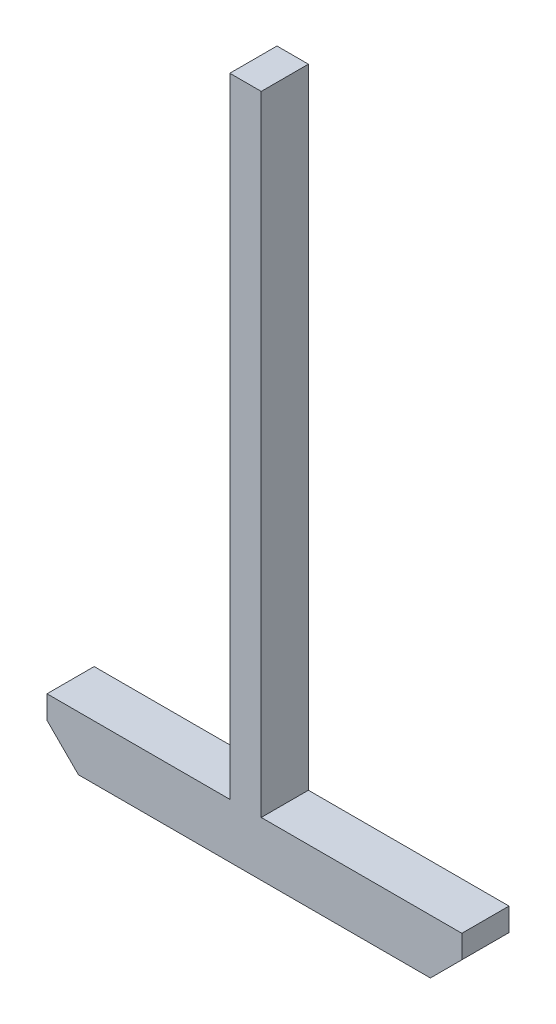
ISO-10303-21;
HEADER;
FILE_DESCRIPTION(('STEP AP214'),'2;1');
FILE_NAME('part.step','',(''),(''),'','','');
FILE_SCHEMA(('AUTOMOTIVE_DESIGN { 1 0 10303 214 1 1 1 1 }'));
ENDSEC;
DATA;
#1=APPLICATION_CONTEXT('core data for automotive mechanical design processes');
#2=APPLICATION_PROTOCOL_DEFINITION('international standard','automotive_design',2000,#1);
#3=PRODUCT_CONTEXT('',#1,'mechanical');
#4=PRODUCT('Part','Part','',(#3));
#5=PRODUCT_RELATED_PRODUCT_CATEGORY('part','',(#4));
#6=PRODUCT_DEFINITION_FORMATION('','',#4);
#7=PRODUCT_DEFINITION_CONTEXT('part definition',#1,'design');
#8=PRODUCT_DEFINITION('design','',#6,#7);
#9=PRODUCT_DEFINITION_SHAPE('','',#8);
#10=(LENGTH_UNIT() NAMED_UNIT(*) SI_UNIT(.MILLI.,.METRE.));
#11=(NAMED_UNIT(*) PLANE_ANGLE_UNIT() SI_UNIT($,.RADIAN.));
#12=(NAMED_UNIT(*) SI_UNIT($,.STERADIAN.) SOLID_ANGLE_UNIT());
#13=UNCERTAINTY_MEASURE_WITH_UNIT(LENGTH_MEASURE(1.E-05),#10,'distance_accuracy_value','');
#14=(GEOMETRIC_REPRESENTATION_CONTEXT(3) GLOBAL_UNCERTAINTY_ASSIGNED_CONTEXT((#13)) GLOBAL_UNIT_ASSIGNED_CONTEXT((#10,
#11,#12)) REPRESENTATION_CONTEXT('',''));
#15=CARTESIAN_POINT('',(0.,0.,0.));
#16=DIRECTION('',(0.,0.,1.));
#17=DIRECTION('',(1.,0.,0.));
#18=AXIS2_PLACEMENT_3D('',#15,#16,#17);
#19=CARTESIAN_POINT('',(-4.48621633540177,146.116981132075,15.));
#20=DIRECTION('',(0.,-1.,0.));
#21=DIRECTION('',(0.,0.,-1.));
#22=AXIS2_PLACEMENT_3D('',#19,#20,#21);
#23=PLANE('',#22);
#24=DIRECTION('',(-1.,0.,0.));
#25=VECTOR('',#24,1.);
#26=CARTESIAN_POINT('',(-4.48621633540177,146.116981132075,0.));
#27=LINE('',#26,#25);
#28=CARTESIAN_POINT('',(5.51378366459823,146.116981132075,0.));
#29=VERTEX_POINT('',#28);
#30=CARTESIAN_POINT('',(-4.48621633540177,146.116981132075,0.));
#31=VERTEX_POINT('',#30);
#32=EDGE_CURVE('E142',#29,#31,#27,.T.);
#33=ORIENTED_EDGE('',*,*,#32,.T.);
#34=DIRECTION('',(0.,0.,-1.));
#35=VECTOR('',#34,1.);
#36=CARTESIAN_POINT('',(-4.48621633540177,146.116981132075,15.));
#37=LINE('',#36,#35);
#38=CARTESIAN_POINT('',(-4.48621633540177,146.116981132075,15.));
#39=VERTEX_POINT('',#38);
#40=EDGE_CURVE('E11',#39,#31,#37,.T.);
#41=ORIENTED_EDGE('',*,*,#40,.F.);
#42=DIRECTION('',(-1.,0.,0.));
#43=VECTOR('',#42,1.);
#44=CARTESIAN_POINT('',(-4.48621633540177,146.116981132075,15.));
#45=LINE('',#44,#43);
#46=CARTESIAN_POINT('',(5.51378366459823,146.116981132075,15.));
#47=VERTEX_POINT('',#46);
#48=EDGE_CURVE('E161',#47,#39,#45,.T.);
#49=ORIENTED_EDGE('',*,*,#48,.F.);
#50=DIRECTION('',(0.,0.,-1.));
#51=VECTOR('',#50,1.);
#52=CARTESIAN_POINT('',(5.51378366459823,146.116981132075,15.));
#53=LINE('',#52,#51);
#54=EDGE_CURVE('E138',#47,#29,#53,.T.);
#55=ORIENTED_EDGE('',*,*,#54,.T.);
#56=EDGE_LOOP('',(#33,#41,#49,#55));
#57=FACE_BOUND('',#56,.T.);
#58=ADVANCED_FACE('F33',(#57),#23,.F.);
#59=CARTESIAN_POINT('',(-4.48621633540177,96.1169811320755,15.));
#60=DIRECTION('',(1.,0.,0.));
#61=DIRECTION('',(0.,0.,-1.));
#62=AXIS2_PLACEMENT_3D('',#59,#60,#61);
#63=PLANE('',#62);
#64=DIRECTION('',(0.,-1.,0.));
#65=VECTOR('',#64,1.);
#66=CARTESIAN_POINT('',(-4.48621633540177,96.1169811320755,0.));
#67=LINE('',#66,#65);
#68=CARTESIAN_POINT('',(-4.48621633540177,-53.8830188679245,0.));
#69=VERTEX_POINT('',#68);
#70=EDGE_CURVE('E145',#31,#69,#67,.T.);
#71=ORIENTED_EDGE('',*,*,#70,.T.);
#72=DIRECTION('',(0.,0.,-1.));
#73=VECTOR('',#72,1.);
#74=CARTESIAN_POINT('',(-4.48621633540177,-53.8830188679245,15.));
#75=LINE('',#74,#73);
#76=CARTESIAN_POINT('',(-4.48621633540177,-53.8830188679245,15.));
#77=VERTEX_POINT('',#76);
#78=EDGE_CURVE('E41',#77,#69,#75,.T.);
#79=ORIENTED_EDGE('',*,*,#78,.F.);
#80=DIRECTION('',(0.,-1.,0.));
#81=VECTOR('',#80,1.);
#82=CARTESIAN_POINT('',(-4.48621633540177,146.116981132075,15.));
#83=LINE('',#82,#81);
#84=EDGE_CURVE('E96',#39,#77,#83,.T.);
#85=ORIENTED_EDGE('',*,*,#84,.F.);
#86=ORIENTED_EDGE('',*,*,#40,.T.);
#87=EDGE_LOOP('',(#71,#79,#85,#86));
#88=FACE_BOUND('',#87,.T.);
#89=ADVANCED_FACE('F208',(#88),#63,.F.);
#90=CARTESIAN_POINT('',(-62.6321037941427,-53.8830188679245,15.));
#91=DIRECTION('',(0.,-1.,0.));
#92=DIRECTION('',(1.,0.,0.));
#93=AXIS2_PLACEMENT_3D('',#90,#91,#92);
#94=PLANE('',#93);
#95=DIRECTION('',(-1.,0.,0.));
#96=VECTOR('',#95,1.);
#97=CARTESIAN_POINT('',(-62.6321037941427,-53.8830188679245,0.));
#98=LINE('',#97,#96);
#99=CARTESIAN_POINT('',(-62.6321037941427,-53.8830188679245,0.));
#100=VERTEX_POINT('',#99);
#101=EDGE_CURVE('E147',#69,#100,#98,.T.);
#102=ORIENTED_EDGE('',*,*,#101,.T.);
#103=DIRECTION('',(0.,0.,-1.));
#104=VECTOR('',#103,1.);
#105=CARTESIAN_POINT('',(-62.6321037941427,-53.8830188679245,15.));
#106=LINE('',#105,#104);
#107=CARTESIAN_POINT('',(-62.6321037941427,-53.8830188679245,15.));
#108=VERTEX_POINT('',#107);
#109=EDGE_CURVE('E174',#108,#100,#106,.T.);
#110=ORIENTED_EDGE('',*,*,#109,.F.);
#111=DIRECTION('',(-1.,0.,0.));
#112=VECTOR('',#111,1.);
#113=CARTESIAN_POINT('',(-62.6321037941427,-53.8830188679245,15.));
#114=LINE('',#113,#112);
#115=EDGE_CURVE('E182',#77,#108,#114,.T.);
#116=ORIENTED_EDGE('',*,*,#115,.F.);
#117=ORIENTED_EDGE('',*,*,#78,.T.);
#118=EDGE_LOOP('',(#102,#110,#116,#117));
#119=FACE_BOUND('',#118,.T.);
#120=ADVANCED_FACE('F180',(#119),#94,.F.);
#121=CARTESIAN_POINT('',(-62.6321037941427,-53.8830188679245,15.));
#122=DIRECTION('',(1.,0.,0.));
#123=DIRECTION('',(0.,0.,-1.));
#124=AXIS2_PLACEMENT_3D('',#121,#122,#123);
#125=PLANE('',#124);
#126=DIRECTION('',(0.,-1.,0.));
#127=VECTOR('',#126,1.);
#128=CARTESIAN_POINT('',(-62.6321037941427,-53.8830188679245,0.));
#129=LINE('',#128,#127);
#130=CARTESIAN_POINT('',(-62.6321037941427,-61.2012450982105,0.));
#131=VERTEX_POINT('',#130);
#132=EDGE_CURVE('E149',#100,#131,#129,.T.);
#133=ORIENTED_EDGE('',*,*,#132,.T.);
#134=DIRECTION('',(0.,0.,-1.));
#135=VECTOR('',#134,1.);
#136=CARTESIAN_POINT('',(-62.6321037941427,-61.2012450982105,15.));
#137=LINE('',#136,#135);
#138=CARTESIAN_POINT('',(-62.6321037941427,-61.2012450982105,15.));
#139=VERTEX_POINT('',#138);
#140=EDGE_CURVE('E171',#139,#131,#137,.T.);
#141=ORIENTED_EDGE('',*,*,#140,.F.);
#142=DIRECTION('',(0.,-1.,0.));
#143=VECTOR('',#142,1.);
#144=CARTESIAN_POINT('',(-62.6321037941427,-53.8830188679245,15.));
#145=LINE('',#144,#143);
#146=EDGE_CURVE('E198',#108,#139,#145,.T.);
#147=ORIENTED_EDGE('',*,*,#146,.F.);
#148=ORIENTED_EDGE('',*,*,#109,.T.);
#149=EDGE_LOOP('',(#133,#141,#147,#148));
#150=FACE_BOUND('',#149,.T.);
#151=ADVANCED_FACE('F189',(#150),#125,.F.);
#152=CARTESIAN_POINT('',(-62.6321037941427,-61.2012450982105,15.));
#153=DIRECTION('',(0.707106781186547,0.707106781186548,0.));
#154=DIRECTION('',(-0.707106781186548,0.707106781186547,0.));
#155=AXIS2_PLACEMENT_3D('',#152,#153,#154);
#156=PLANE('',#155);
#157=DIRECTION('',(0.707106781186548,-0.707106781186547,0.));
#158=VECTOR('',#157,1.);
#159=CARTESIAN_POINT('',(-62.6321037941427,-61.2012450982105,0.));
#160=LINE('',#159,#158);
#161=CARTESIAN_POINT('',(-52.6321037941427,-71.2012450982105,0.));
#162=VERTEX_POINT('',#161);
#163=EDGE_CURVE('E151',#131,#162,#160,.T.);
#164=ORIENTED_EDGE('',*,*,#163,.T.);
#165=DIRECTION('',(0.,0.,-1.));
#166=VECTOR('',#165,1.);
#167=CARTESIAN_POINT('',(-52.6321037941427,-71.2012450982105,15.));
#168=LINE('',#167,#166);
#169=CARTESIAN_POINT('',(-52.6321037941427,-71.2012450982105,15.));
#170=VERTEX_POINT('',#169);
#171=EDGE_CURVE('E168',#170,#162,#168,.T.);
#172=ORIENTED_EDGE('',*,*,#171,.F.);
#173=DIRECTION('',(0.707106781186548,-0.707106781186547,0.));
#174=VECTOR('',#173,1.);
#175=CARTESIAN_POINT('',(-62.6321037941427,-61.2012450982105,15.));
#176=LINE('',#175,#174);
#177=EDGE_CURVE('E195',#139,#170,#176,.T.);
#178=ORIENTED_EDGE('',*,*,#177,.F.);
#179=ORIENTED_EDGE('',*,*,#140,.T.);
#180=EDGE_LOOP('',(#164,#172,#178,#179));
#181=FACE_BOUND('',#180,.T.);
#182=ADVANCED_FACE('F193',(#181),#156,.F.);
#183=CARTESIAN_POINT('',(-52.6321037941427,-71.2012450982105,15.));
#184=DIRECTION('',(0.,1.,0.));
#185=DIRECTION('',(0.,0.,1.));
#186=AXIS2_PLACEMENT_3D('',#183,#184,#185);
#187=PLANE('',#186);
#188=DIRECTION('',(1.,0.,0.));
#189=VECTOR('',#188,1.);
#190=CARTESIAN_POINT('',(-52.6321037941427,-71.2012450982105,0.));
#191=LINE('',#190,#189);
#192=CARTESIAN_POINT('',(59.3154546983647,-71.2012450982105,0.));
#193=VERTEX_POINT('',#192);
#194=EDGE_CURVE('E153',#162,#193,#191,.T.);
#195=ORIENTED_EDGE('',*,*,#194,.T.);
#196=DIRECTION('',(0.,0.,-1.));
#197=VECTOR('',#196,1.);
#198=CARTESIAN_POINT('',(59.3154546983647,-71.2012450982105,15.));
#199=LINE('',#198,#197);
#200=CARTESIAN_POINT('',(59.3154546983647,-71.2012450982105,15.));
#201=VERTEX_POINT('',#200);
#202=EDGE_CURVE('E165',#201,#193,#199,.T.);
#203=ORIENTED_EDGE('',*,*,#202,.F.);
#204=DIRECTION('',(1.,0.,0.));
#205=VECTOR('',#204,1.);
#206=CARTESIAN_POINT('',(-52.6321037941427,-71.2012450982105,15.));
#207=LINE('',#206,#205);
#208=EDGE_CURVE('E197',#170,#201,#207,.T.);
#209=ORIENTED_EDGE('',*,*,#208,.F.);
#210=ORIENTED_EDGE('',*,*,#171,.T.);
#211=EDGE_LOOP('',(#195,#203,#209,#210));
#212=FACE_BOUND('',#211,.T.);
#213=ADVANCED_FACE('F220',(#212),#187,.F.);
#214=CARTESIAN_POINT('',(59.3154546983647,-71.2012450982105,15.));
#215=DIRECTION('',(-0.707106781186548,0.707106781186547,0.));
#216=DIRECTION('',(-0.707106781186547,-0.707106781186548,0.));
#217=AXIS2_PLACEMENT_3D('',#214,#215,#216);
#218=PLANE('',#217);
#219=DIRECTION('',(0.707106781186547,0.707106781186548,0.));
#220=VECTOR('',#219,1.);
#221=CARTESIAN_POINT('',(59.3154546983647,-71.2012450982105,0.));
#222=LINE('',#221,#220);
#223=CARTESIAN_POINT('',(69.3154546983647,-61.2012450982105,0.));
#224=VERTEX_POINT('',#223);
#225=EDGE_CURVE('E155',#193,#224,#222,.T.);
#226=ORIENTED_EDGE('',*,*,#225,.T.);
#227=DIRECTION('',(0.,0.,-1.));
#228=VECTOR('',#227,1.);
#229=CARTESIAN_POINT('',(69.3154546983647,-61.2012450982105,15.));
#230=LINE('',#229,#228);
#231=CARTESIAN_POINT('',(69.3154546983647,-61.2012450982105,15.));
#232=VERTEX_POINT('',#231);
#233=EDGE_CURVE('E133',#232,#224,#230,.T.);
#234=ORIENTED_EDGE('',*,*,#233,.F.);
#235=DIRECTION('',(0.707106781186547,0.707106781186548,0.));
#236=VECTOR('',#235,1.);
#237=CARTESIAN_POINT('',(59.3154546983647,-71.2012450982105,15.));
#238=LINE('',#237,#236);
#239=EDGE_CURVE('E122',#201,#232,#238,.T.);
#240=ORIENTED_EDGE('',*,*,#239,.F.);
#241=ORIENTED_EDGE('',*,*,#202,.T.);
#242=EDGE_LOOP('',(#226,#234,#240,#241));
#243=FACE_BOUND('',#242,.T.);
#244=ADVANCED_FACE('F223',(#243),#218,.F.);
#245=CARTESIAN_POINT('',(69.3154546983647,-53.8830188679245,15.));
#246=DIRECTION('',(-1.,0.,0.));
#247=DIRECTION('',(0.,0.,1.));
#248=AXIS2_PLACEMENT_3D('',#245,#246,#247);
#249=PLANE('',#248);
#250=DIRECTION('',(0.,1.,0.));
#251=VECTOR('',#250,1.);
#252=CARTESIAN_POINT('',(69.3154546983647,-53.8830188679245,0.));
#253=LINE('',#252,#251);
#254=CARTESIAN_POINT('',(69.3154546983647,-53.8830188679245,0.));
#255=VERTEX_POINT('',#254);
#256=EDGE_CURVE('E131',#224,#255,#253,.T.);
#257=ORIENTED_EDGE('',*,*,#256,.T.);
#258=DIRECTION('',(0.,0.,-1.));
#259=VECTOR('',#258,1.);
#260=CARTESIAN_POINT('',(69.3154546983647,-53.8830188679245,15.));
#261=LINE('',#260,#259);
#262=CARTESIAN_POINT('',(69.3154546983647,-53.8830188679245,15.));
#263=VERTEX_POINT('',#262);
#264=EDGE_CURVE('E128',#263,#255,#261,.T.);
#265=ORIENTED_EDGE('',*,*,#264,.F.);
#266=DIRECTION('',(0.,1.,0.));
#267=VECTOR('',#266,1.);
#268=CARTESIAN_POINT('',(69.3154546983647,-53.8830188679245,15.));
#269=LINE('',#268,#267);
#270=EDGE_CURVE('E115',#232,#263,#269,.T.);
#271=ORIENTED_EDGE('',*,*,#270,.F.);
#272=ORIENTED_EDGE('',*,*,#233,.T.);
#273=EDGE_LOOP('',(#257,#265,#271,#272));
#274=FACE_BOUND('',#273,.T.);
#275=ADVANCED_FACE('F129',(#274),#249,.F.);
#276=CARTESIAN_POINT('',(5.51378366459823,-53.8830188679245,15.));
#277=DIRECTION('',(0.,-1.,0.));
#278=DIRECTION('',(0.,0.,-1.));
#279=AXIS2_PLACEMENT_3D('',#276,#277,#278);
#280=PLANE('',#279);
#281=DIRECTION('',(-1.,0.,0.));
#282=VECTOR('',#281,1.);
#283=CARTESIAN_POINT('',(5.51378366459823,-53.8830188679245,0.));
#284=LINE('',#283,#282);
#285=CARTESIAN_POINT('',(5.51378366459823,-53.8830188679245,0.));
#286=VERTEX_POINT('',#285);
#287=EDGE_CURVE('E158',#255,#286,#284,.T.);
#288=ORIENTED_EDGE('',*,*,#287,.T.);
#289=DIRECTION('',(0.,0.,-1.));
#290=VECTOR('',#289,1.);
#291=CARTESIAN_POINT('',(5.51378366459823,-53.8830188679245,15.));
#292=LINE('',#291,#290);
#293=CARTESIAN_POINT('',(5.51378366459823,-53.8830188679245,15.));
#294=VERTEX_POINT('',#293);
#295=EDGE_CURVE('E134',#294,#286,#292,.T.);
#296=ORIENTED_EDGE('',*,*,#295,.F.);
#297=DIRECTION('',(-1.,0.,0.));
#298=VECTOR('',#297,1.);
#299=CARTESIAN_POINT('',(5.51378366459823,-53.8830188679245,15.));
#300=LINE('',#299,#298);
#301=EDGE_CURVE('E119',#263,#294,#300,.T.);
#302=ORIENTED_EDGE('',*,*,#301,.F.);
#303=ORIENTED_EDGE('',*,*,#264,.T.);
#304=EDGE_LOOP('',(#288,#296,#302,#303));
#305=FACE_BOUND('',#304,.T.);
#306=ADVANCED_FACE('F136',(#305),#280,.F.);
#307=CARTESIAN_POINT('',(5.51378366459823,96.1169811320755,15.));
#308=DIRECTION('',(-1.,0.,0.));
#309=DIRECTION('',(0.,0.,1.));
#310=AXIS2_PLACEMENT_3D('',#307,#308,#309);
#311=PLANE('',#310);
#312=DIRECTION('',(0.,1.,0.));
#313=VECTOR('',#312,1.);
#314=CARTESIAN_POINT('',(5.51378366459823,96.1169811320755,0.));
#315=LINE('',#314,#313);
#316=EDGE_CURVE('E84',#286,#29,#315,.T.);
#317=ORIENTED_EDGE('',*,*,#316,.T.);
#318=ORIENTED_EDGE('',*,*,#54,.F.);
#319=DIRECTION('',(0.,1.,0.));
#320=VECTOR('',#319,1.);
#321=CARTESIAN_POINT('',(5.51378366459823,96.1169811320755,15.));
#322=LINE('',#321,#320);
#323=EDGE_CURVE('E49',#294,#47,#322,.T.);
#324=ORIENTED_EDGE('',*,*,#323,.F.);
#325=ORIENTED_EDGE('',*,*,#295,.T.);
#326=EDGE_LOOP('',(#317,#318,#324,#325));
#327=FACE_BOUND('',#326,.T.);
#328=ADVANCED_FACE('F232',(#327),#311,.F.);
#329=CARTESIAN_POINT('',(0.,0.,15.));
#330=DIRECTION('',(0.,0.,1.));
#331=DIRECTION('',(1.,0.,0.));
#332=AXIS2_PLACEMENT_3D('',#329,#330,#331);
#333=PLANE('',#332);
#334=ORIENTED_EDGE('',*,*,#48,.T.);
#335=ORIENTED_EDGE('',*,*,#84,.T.);
#336=ORIENTED_EDGE('',*,*,#115,.T.);
#337=ORIENTED_EDGE('',*,*,#146,.T.);
#338=ORIENTED_EDGE('',*,*,#177,.T.);
#339=ORIENTED_EDGE('',*,*,#208,.T.);
#340=ORIENTED_EDGE('',*,*,#239,.T.);
#341=ORIENTED_EDGE('',*,*,#270,.T.);
#342=ORIENTED_EDGE('',*,*,#301,.T.);
#343=ORIENTED_EDGE('',*,*,#323,.T.);
#344=EDGE_LOOP('',(#334,#335,#336,#337,#338,#339,#340,#341,#342,#343));
#345=FACE_BOUND('',#344,.T.);
#346=ADVANCED_FACE('F117',(#345),#333,.T.);
#347=CARTESIAN_POINT('',(0.,0.,0.));
#348=DIRECTION('',(0.,0.,1.));
#349=DIRECTION('',(1.,0.,0.));
#350=AXIS2_PLACEMENT_3D('',#347,#348,#349);
#351=PLANE('',#350);
#352=ORIENTED_EDGE('',*,*,#32,.F.);
#353=ORIENTED_EDGE('',*,*,#316,.F.);
#354=ORIENTED_EDGE('',*,*,#287,.F.);
#355=ORIENTED_EDGE('',*,*,#256,.F.);
#356=ORIENTED_EDGE('',*,*,#225,.F.);
#357=ORIENTED_EDGE('',*,*,#194,.F.);
#358=ORIENTED_EDGE('',*,*,#163,.F.);
#359=ORIENTED_EDGE('',*,*,#132,.F.);
#360=ORIENTED_EDGE('',*,*,#101,.F.);
#361=ORIENTED_EDGE('',*,*,#70,.F.);
#362=EDGE_LOOP('',(#352,#353,#354,#355,#356,#357,#358,#359,#360,#361));
#363=FACE_BOUND('',#362,.T.);
#364=ADVANCED_FACE('F184',(#363),#351,.F.);
#365=CLOSED_SHELL('',(#58,#89,#120,#151,#182,#213,#244,#275,#306,#328,#346,#364));
#366=MANIFOLD_SOLID_BREP('B2',#365);
#367=ADVANCED_BREP_SHAPE_REPRESENTATION('',(#18,#366),#14);
#368=SHAPE_DEFINITION_REPRESENTATION(#9,#367);
ENDSEC;
END-ISO-10303-21;
